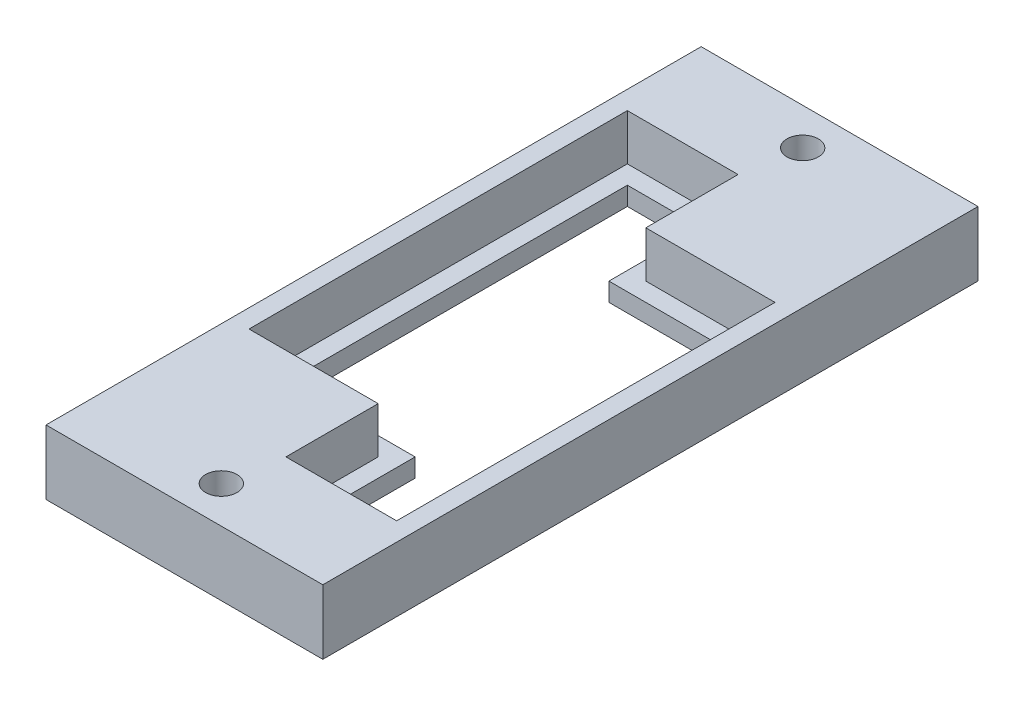
ISO-10303-21;
HEADER;
FILE_DESCRIPTION(('STEP AP214'),'2;1');
FILE_NAME('part.step','',(''),(''),'','','');
FILE_SCHEMA(('AUTOMOTIVE_DESIGN { 1 0 10303 214 1 1 1 1 }'));
ENDSEC;
DATA;
#1=APPLICATION_CONTEXT('core data for automotive mechanical design processes');
#2=APPLICATION_PROTOCOL_DEFINITION('international standard','automotive_design',2000,#1);
#3=PRODUCT_CONTEXT('',#1,'mechanical');
#4=PRODUCT('Part','Part','',(#3));
#5=PRODUCT_RELATED_PRODUCT_CATEGORY('part','',(#4));
#6=PRODUCT_DEFINITION_FORMATION('','',#4);
#7=PRODUCT_DEFINITION_CONTEXT('part definition',#1,'design');
#8=PRODUCT_DEFINITION('design','',#6,#7);
#9=PRODUCT_DEFINITION_SHAPE('','',#8);
#10=(LENGTH_UNIT() NAMED_UNIT(*) SI_UNIT(.MILLI.,.METRE.));
#11=(NAMED_UNIT(*) PLANE_ANGLE_UNIT() SI_UNIT($,.RADIAN.));
#12=(NAMED_UNIT(*) SI_UNIT($,.STERADIAN.) SOLID_ANGLE_UNIT());
#13=UNCERTAINTY_MEASURE_WITH_UNIT(LENGTH_MEASURE(1.E-05),#10,'distance_accuracy_value','');
#14=(GEOMETRIC_REPRESENTATION_CONTEXT(3) GLOBAL_UNCERTAINTY_ASSIGNED_CONTEXT((#13)) GLOBAL_UNIT_ASSIGNED_CONTEXT((#10,
#11,#12)) REPRESENTATION_CONTEXT('',''));
#15=CARTESIAN_POINT('',(0.,0.,0.));
#16=DIRECTION('',(0.,0.,1.));
#17=DIRECTION('',(1.,0.,0.));
#18=AXIS2_PLACEMENT_3D('',#15,#16,#17);
#19=CARTESIAN_POINT('',(-6.02197802197803,2.,0.));
#20=DIRECTION('',(-1.,0.,0.));
#21=DIRECTION('',(0.,0.,1.));
#22=AXIS2_PLACEMENT_3D('',#19,#20,#21);
#23=PLANE('',#22);
#24=DIRECTION('',(0.,0.,-1.));
#25=VECTOR('',#24,1.);
#26=CARTESIAN_POINT('',(-6.02197802197803,0.,0.));
#27=LINE('',#26,#25);
#28=CARTESIAN_POINT('',(-6.02197802197803,0.,-6.26799641166373));
#29=VERTEX_POINT('',#28);
#30=CARTESIAN_POINT('',(-6.02197802197803,0.,-16.2679964116637));
#31=VERTEX_POINT('',#30);
#32=EDGE_CURVE('E180',#29,#31,#27,.T.);
#33=ORIENTED_EDGE('',*,*,#32,.F.);
#34=DIRECTION('',(0.,-1.,0.));
#35=VECTOR('',#34,1.);
#36=CARTESIAN_POINT('',(-6.02197802197803,2.,-6.26799641166373));
#37=LINE('',#36,#35);
#38=CARTESIAN_POINT('',(-6.02197802197803,2.,-6.26799641166373));
#39=VERTEX_POINT('',#38);
#40=EDGE_CURVE('E11',#39,#29,#37,.T.);
#41=ORIENTED_EDGE('',*,*,#40,.F.);
#42=DIRECTION('',(0.,0.,-1.));
#43=VECTOR('',#42,1.);
#44=CARTESIAN_POINT('',(-6.02197802197803,2.,0.));
#45=LINE('',#44,#43);
#46=CARTESIAN_POINT('',(-6.02197802197803,2.,-16.2679964116637));
#47=VERTEX_POINT('',#46);
#48=EDGE_CURVE('E209',#39,#47,#45,.T.);
#49=ORIENTED_EDGE('',*,*,#48,.T.);
#50=DIRECTION('',(0.,-1.,0.));
#51=VECTOR('',#50,1.);
#52=CARTESIAN_POINT('',(-6.02197802197803,2.,-16.2679964116637));
#53=LINE('',#52,#51);
#54=EDGE_CURVE('E99',#47,#31,#53,.T.);
#55=ORIENTED_EDGE('',*,*,#54,.T.);
#56=EDGE_LOOP('',(#33,#41,#49,#55));
#57=FACE_BOUND('',#56,.T.);
#58=ADVANCED_FACE('F45',(#57),#23,.T.);
#59=CARTESIAN_POINT('',(0.,2.,-6.26799641166373));
#60=DIRECTION('',(0.,0.,1.));
#61=DIRECTION('',(1.,0.,0.));
#62=AXIS2_PLACEMENT_3D('',#59,#60,#61);
#63=PLANE('',#62);
#64=DIRECTION('',(-1.,0.,0.));
#65=VECTOR('',#64,1.);
#66=CARTESIAN_POINT('',(0.,0.,-6.26799641166373));
#67=LINE('',#66,#65);
#68=CARTESIAN_POINT('',(7.97802197802194,0.,-6.26799641166374));
#69=VERTEX_POINT('',#68);
#70=EDGE_CURVE('E183',#69,#29,#67,.T.);
#71=ORIENTED_EDGE('',*,*,#70,.F.);
#72=DIRECTION('',(0.,-1.,0.));
#73=VECTOR('',#72,1.);
#74=CARTESIAN_POINT('',(7.97802197802194,2.,-6.26799641166374));
#75=LINE('',#74,#73);
#76=CARTESIAN_POINT('',(7.97802197802194,2.,-6.26799641166374));
#77=VERTEX_POINT('',#76);
#78=EDGE_CURVE('E54',#77,#69,#75,.T.);
#79=ORIENTED_EDGE('',*,*,#78,.F.);
#80=DIRECTION('',(-1.,0.,0.));
#81=VECTOR('',#80,1.);
#82=CARTESIAN_POINT('',(0.,2.,-6.26799641166373));
#83=LINE('',#82,#81);
#84=EDGE_CURVE('E245',#77,#39,#83,.T.);
#85=ORIENTED_EDGE('',*,*,#84,.T.);
#86=ORIENTED_EDGE('',*,*,#40,.T.);
#87=EDGE_LOOP('',(#71,#79,#85,#86));
#88=FACE_BOUND('',#87,.T.);
#89=ADVANCED_FACE('F233',(#88),#63,.T.);
#90=CARTESIAN_POINT('',(7.97802197802194,2.,0.));
#91=DIRECTION('',(-1.,0.,0.));
#92=DIRECTION('',(0.,0.,1.));
#93=AXIS2_PLACEMENT_3D('',#90,#91,#92);
#94=PLANE('',#93);
#95=DIRECTION('',(0.,0.,-1.));
#96=VECTOR('',#95,1.);
#97=CARTESIAN_POINT('',(7.97802197802194,0.,0.));
#98=LINE('',#97,#96);
#99=CARTESIAN_POINT('',(7.97802197802194,0.,30.7320035883363));
#100=VERTEX_POINT('',#99);
#101=EDGE_CURVE('E188',#100,#69,#98,.T.);
#102=ORIENTED_EDGE('',*,*,#101,.F.);
#103=DIRECTION('',(0.,-1.,0.));
#104=VECTOR('',#103,1.);
#105=CARTESIAN_POINT('',(7.97802197802194,2.,30.7320035883363));
#106=LINE('',#105,#104);
#107=CARTESIAN_POINT('',(7.97802197802194,2.,30.7320035883363));
#108=VERTEX_POINT('',#107);
#109=EDGE_CURVE('E220',#108,#100,#106,.T.);
#110=ORIENTED_EDGE('',*,*,#109,.F.);
#111=DIRECTION('',(0.,0.,-1.));
#112=VECTOR('',#111,1.);
#113=CARTESIAN_POINT('',(7.97802197802194,2.,0.));
#114=LINE('',#113,#112);
#115=EDGE_CURVE('E229',#108,#77,#114,.T.);
#116=ORIENTED_EDGE('',*,*,#115,.T.);
#117=ORIENTED_EDGE('',*,*,#78,.T.);
#118=EDGE_LOOP('',(#102,#110,#116,#117));
#119=FACE_BOUND('',#118,.T.);
#120=ADVANCED_FACE('F227',(#119),#94,.T.);
#121=CARTESIAN_POINT('',(0.,2.,30.7320035883363));
#122=DIRECTION('',(0.,0.,-1.));
#123=DIRECTION('',(-1.,0.,0.));
#124=AXIS2_PLACEMENT_3D('',#121,#122,#123);
#125=PLANE('',#124);
#126=DIRECTION('',(1.,0.,0.));
#127=VECTOR('',#126,1.);
#128=CARTESIAN_POINT('',(0.,0.,30.7320035883363));
#129=LINE('',#128,#127);
#130=CARTESIAN_POINT('',(-0.0219780219780545,0.,30.7320035883363));
#131=VERTEX_POINT('',#130);
#132=EDGE_CURVE('E192',#131,#100,#129,.T.);
#133=ORIENTED_EDGE('',*,*,#132,.F.);
#134=DIRECTION('',(0.,-1.,0.));
#135=VECTOR('',#134,1.);
#136=CARTESIAN_POINT('',(-0.0219780219780545,2.,30.7320035883363));
#137=LINE('',#136,#135);
#138=CARTESIAN_POINT('',(-0.0219780219780545,2.,30.7320035883363));
#139=VERTEX_POINT('',#138);
#140=EDGE_CURVE('E217',#139,#131,#137,.T.);
#141=ORIENTED_EDGE('',*,*,#140,.F.);
#142=DIRECTION('',(1.,0.,0.));
#143=VECTOR('',#142,1.);
#144=CARTESIAN_POINT('',(0.,2.,30.7320035883363));
#145=LINE('',#144,#143);
#146=EDGE_CURVE('E243',#139,#108,#145,.T.);
#147=ORIENTED_EDGE('',*,*,#146,.T.);
#148=ORIENTED_EDGE('',*,*,#109,.T.);
#149=EDGE_LOOP('',(#133,#141,#147,#148));
#150=FACE_BOUND('',#149,.T.);
#151=ADVANCED_FACE('F240',(#150),#125,.T.);
#152=CARTESIAN_POINT('',(-0.0219780219780545,2.,0.));
#153=DIRECTION('',(1.,0.,0.));
#154=DIRECTION('',(0.,0.,-1.));
#155=AXIS2_PLACEMENT_3D('',#152,#153,#154);
#156=PLANE('',#155);
#157=DIRECTION('',(0.,0.,1.));
#158=VECTOR('',#157,1.);
#159=CARTESIAN_POINT('',(-0.0219780219780545,0.,0.));
#160=LINE('',#159,#158);
#161=CARTESIAN_POINT('',(-0.0219780219780545,0.,20.7320035883363));
#162=VERTEX_POINT('',#161);
#163=EDGE_CURVE('E196',#162,#131,#160,.T.);
#164=ORIENTED_EDGE('',*,*,#163,.F.);
#165=DIRECTION('',(0.,-1.,0.));
#166=VECTOR('',#165,1.);
#167=CARTESIAN_POINT('',(-0.0219780219780545,2.,20.7320035883363));
#168=LINE('',#167,#166);
#169=CARTESIAN_POINT('',(-0.0219780219780545,2.,20.7320035883363));
#170=VERTEX_POINT('',#169);
#171=EDGE_CURVE('E214',#170,#162,#168,.T.);
#172=ORIENTED_EDGE('',*,*,#171,.F.);
#173=DIRECTION('',(0.,0.,1.));
#174=VECTOR('',#173,1.);
#175=CARTESIAN_POINT('',(-0.0219780219780545,2.,0.));
#176=LINE('',#175,#174);
#177=EDGE_CURVE('E250',#170,#139,#176,.T.);
#178=ORIENTED_EDGE('',*,*,#177,.T.);
#179=ORIENTED_EDGE('',*,*,#140,.T.);
#180=EDGE_LOOP('',(#164,#172,#178,#179));
#181=FACE_BOUND('',#180,.T.);
#182=ADVANCED_FACE('F271',(#181),#156,.T.);
#183=CARTESIAN_POINT('',(0.,2.,20.7320035883363));
#184=DIRECTION('',(0.,0.,-1.));
#185=DIRECTION('',(-1.,0.,0.));
#186=AXIS2_PLACEMENT_3D('',#183,#184,#185);
#187=PLANE('',#186);
#188=DIRECTION('',(1.,0.,0.));
#189=VECTOR('',#188,1.);
#190=CARTESIAN_POINT('',(0.,0.,20.7320035883363));
#191=LINE('',#190,#189);
#192=CARTESIAN_POINT('',(-14.0219780219781,0.,20.7320035883363));
#193=VERTEX_POINT('',#192);
#194=EDGE_CURVE('E200',#193,#162,#191,.T.);
#195=ORIENTED_EDGE('',*,*,#194,.F.);
#196=DIRECTION('',(0.,-1.,0.));
#197=VECTOR('',#196,1.);
#198=CARTESIAN_POINT('',(-14.0219780219781,2.,20.7320035883363));
#199=LINE('',#198,#197);
#200=CARTESIAN_POINT('',(-14.0219780219781,2.,20.7320035883363));
#201=VERTEX_POINT('',#200);
#202=EDGE_CURVE('E130',#201,#193,#199,.T.);
#203=ORIENTED_EDGE('',*,*,#202,.F.);
#204=DIRECTION('',(1.,0.,0.));
#205=VECTOR('',#204,1.);
#206=CARTESIAN_POINT('',(0.,2.,20.7320035883363));
#207=LINE('',#206,#205);
#208=EDGE_CURVE('E140',#201,#170,#207,.T.);
#209=ORIENTED_EDGE('',*,*,#208,.T.);
#210=ORIENTED_EDGE('',*,*,#171,.T.);
#211=EDGE_LOOP('',(#195,#203,#209,#210));
#212=FACE_BOUND('',#211,.T.);
#213=ADVANCED_FACE('F259',(#212),#187,.T.);
#214=CARTESIAN_POINT('',(-14.0219780219781,2.,0.));
#215=DIRECTION('',(1.,0.,0.));
#216=DIRECTION('',(0.,0.,-1.));
#217=AXIS2_PLACEMENT_3D('',#214,#215,#216);
#218=PLANE('',#217);
#219=DIRECTION('',(0.,0.,1.));
#220=VECTOR('',#219,1.);
#221=CARTESIAN_POINT('',(-14.0219780219781,0.,0.));
#222=LINE('',#221,#220);
#223=CARTESIAN_POINT('',(-14.0219780219781,0.,-16.2679964116637));
#224=VERTEX_POINT('',#223);
#225=EDGE_CURVE('E127',#224,#193,#222,.T.);
#226=ORIENTED_EDGE('',*,*,#225,.F.);
#227=DIRECTION('',(0.,-1.,0.));
#228=VECTOR('',#227,1.);
#229=CARTESIAN_POINT('',(-14.0219780219781,2.,-16.2679964116637));
#230=LINE('',#229,#228);
#231=CARTESIAN_POINT('',(-14.0219780219781,2.,-16.2679964116637));
#232=VERTEX_POINT('',#231);
#233=EDGE_CURVE('E92',#232,#224,#230,.T.);
#234=ORIENTED_EDGE('',*,*,#233,.F.);
#235=DIRECTION('',(0.,0.,1.));
#236=VECTOR('',#235,1.);
#237=CARTESIAN_POINT('',(-14.0219780219781,2.,0.));
#238=LINE('',#237,#236);
#239=EDGE_CURVE('E125',#232,#201,#238,.T.);
#240=ORIENTED_EDGE('',*,*,#239,.T.);
#241=ORIENTED_EDGE('',*,*,#202,.T.);
#242=EDGE_LOOP('',(#226,#234,#240,#241));
#243=FACE_BOUND('',#242,.T.);
#244=ADVANCED_FACE('F124',(#243),#218,.T.);
#245=CARTESIAN_POINT('',(0.,2.,-16.2679964116637));
#246=DIRECTION('',(0.,0.,1.));
#247=DIRECTION('',(1.,0.,0.));
#248=AXIS2_PLACEMENT_3D('',#245,#246,#247);
#249=PLANE('',#248);
#250=DIRECTION('',(-1.,0.,0.));
#251=VECTOR('',#250,1.);
#252=CARTESIAN_POINT('',(0.,0.,-16.2679964116637));
#253=LINE('',#252,#251);
#254=EDGE_CURVE('E206',#31,#224,#253,.T.);
#255=ORIENTED_EDGE('',*,*,#254,.F.);
#256=ORIENTED_EDGE('',*,*,#54,.F.);
#257=DIRECTION('',(-1.,0.,0.));
#258=VECTOR('',#257,1.);
#259=CARTESIAN_POINT('',(0.,2.,-16.2679964116637));
#260=LINE('',#259,#258);
#261=EDGE_CURVE('E137',#47,#232,#260,.T.);
#262=ORIENTED_EDGE('',*,*,#261,.T.);
#263=ORIENTED_EDGE('',*,*,#233,.T.);
#264=EDGE_LOOP('',(#255,#256,#262,#263));
#265=FACE_BOUND('',#264,.T.);
#266=ADVANCED_FACE('F143',(#265),#249,.T.);
#267=CARTESIAN_POINT('',(0.,2.,0.));
#268=DIRECTION('',(0.,1.,0.));
#269=DIRECTION('',(0.,0.,1.));
#270=AXIS2_PLACEMENT_3D('',#267,#268,#269);
#271=PLANE('',#270);
#272=ORIENTED_EDGE('',*,*,#48,.F.);
#273=ORIENTED_EDGE('',*,*,#84,.F.);
#274=ORIENTED_EDGE('',*,*,#115,.F.);
#275=ORIENTED_EDGE('',*,*,#146,.F.);
#276=ORIENTED_EDGE('',*,*,#177,.F.);
#277=ORIENTED_EDGE('',*,*,#208,.F.);
#278=ORIENTED_EDGE('',*,*,#239,.F.);
#279=ORIENTED_EDGE('',*,*,#261,.F.);
#280=EDGE_LOOP('',(#272,#273,#274,#275,#276,#277,#278,#279));
#281=FACE_BOUND('',#280,.T.);
#282=DIRECTION('',(0.,0.,-1.));
#283=VECTOR('',#282,1.);
#284=CARTESIAN_POINT('',(-4.02197802197803,2.,0.));
#285=LINE('',#284,#283);
#286=CARTESIAN_POINT('',(-4.02197802197803,2.,-8.26799641166373));
#287=VERTEX_POINT('',#286);
#288=CARTESIAN_POINT('',(-4.02197802197803,2.,-18.2679964116637));
#289=VERTEX_POINT('',#288);
#290=EDGE_CURVE('E145',#287,#289,#285,.T.);
#291=ORIENTED_EDGE('',*,*,#290,.T.);
#292=DIRECTION('',(-1.,0.,0.));
#293=VECTOR('',#292,1.);
#294=CARTESIAN_POINT('',(0.,2.,-18.2679964116637));
#295=LINE('',#294,#293);
#296=CARTESIAN_POINT('',(-16.0219780219781,2.,-18.2679964116637));
#297=VERTEX_POINT('',#296);
#298=EDGE_CURVE('E149',#289,#297,#295,.T.);
#299=ORIENTED_EDGE('',*,*,#298,.T.);
#300=DIRECTION('',(0.,0.,1.));
#301=VECTOR('',#300,1.);
#302=CARTESIAN_POINT('',(-16.0219780219781,2.,0.));
#303=LINE('',#302,#301);
#304=CARTESIAN_POINT('',(-16.0219780219781,2.,22.7320035883363));
#305=VERTEX_POINT('',#304);
#306=EDGE_CURVE('E156',#297,#305,#303,.T.);
#307=ORIENTED_EDGE('',*,*,#306,.T.);
#308=DIRECTION('',(1.,0.,0.));
#309=VECTOR('',#308,1.);
#310=CARTESIAN_POINT('',(0.,2.,22.7320035883363));
#311=LINE('',#310,#309);
#312=CARTESIAN_POINT('',(-2.02197802197805,2.,22.7320035883363));
#313=VERTEX_POINT('',#312);
#314=EDGE_CURVE('E160',#305,#313,#311,.T.);
#315=ORIENTED_EDGE('',*,*,#314,.T.);
#316=DIRECTION('',(0.,0.,1.));
#317=VECTOR('',#316,1.);
#318=CARTESIAN_POINT('',(-2.02197802197806,2.,0.));
#319=LINE('',#318,#317);
#320=CARTESIAN_POINT('',(-2.02197802197805,2.,32.7320035883363));
#321=VERTEX_POINT('',#320);
#322=EDGE_CURVE('E164',#313,#321,#319,.T.);
#323=ORIENTED_EDGE('',*,*,#322,.T.);
#324=DIRECTION('',(1.,0.,0.));
#325=VECTOR('',#324,1.);
#326=CARTESIAN_POINT('',(0.,2.,32.7320035883363));
#327=LINE('',#326,#325);
#328=CARTESIAN_POINT('',(9.97802197802194,2.,32.7320035883363));
#329=VERTEX_POINT('',#328);
#330=EDGE_CURVE('E168',#321,#329,#327,.T.);
#331=ORIENTED_EDGE('',*,*,#330,.T.);
#332=DIRECTION('',(0.,0.,-1.));
#333=VECTOR('',#332,1.);
#334=CARTESIAN_POINT('',(9.97802197802194,2.,0.));
#335=LINE('',#334,#333);
#336=CARTESIAN_POINT('',(9.97802197802194,2.,-8.26799641166374));
#337=VERTEX_POINT('',#336);
#338=EDGE_CURVE('E172',#329,#337,#335,.T.);
#339=ORIENTED_EDGE('',*,*,#338,.T.);
#340=DIRECTION('',(-1.,0.,0.));
#341=VECTOR('',#340,1.);
#342=CARTESIAN_POINT('',(0.,2.,-8.26799641166373));
#343=LINE('',#342,#341);
#344=EDGE_CURVE('E176',#337,#287,#343,.T.);
#345=ORIENTED_EDGE('',*,*,#344,.T.);
#346=EDGE_LOOP('',(#291,#299,#307,#315,#323,#331,#339,#345));
#347=FACE_BOUND('',#346,.T.);
#348=ADVANCED_FACE('F135',(#281,#347),#271,.T.);
#349=CARTESIAN_POINT('',(0.,0.,0.));
#350=DIRECTION('',(0.,1.,0.));
#351=DIRECTION('',(0.,0.,1.));
#352=AXIS2_PLACEMENT_3D('',#349,#350,#351);
#353=PLANE('',#352);
#354=DIRECTION('',(0.,0.,-1.));
#355=VECTOR('',#354,1.);
#356=CARTESIAN_POINT('',(11.9780219780219,0.,0.));
#357=LINE('',#356,#355);
#358=CARTESIAN_POINT('',(11.9780219780219,0.,42.7320035883363));
#359=VERTEX_POINT('',#358);
#360=CARTESIAN_POINT('',(11.9780219780219,0.,-28.2679964116637));
#361=VERTEX_POINT('',#360);
#362=EDGE_CURVE('E405',#359,#361,#357,.T.);
#363=ORIENTED_EDGE('',*,*,#362,.F.);
#364=DIRECTION('',(1.,0.,0.));
#365=VECTOR('',#364,1.);
#366=CARTESIAN_POINT('',(0.,0.,42.7320035883363));
#367=LINE('',#366,#365);
#368=CARTESIAN_POINT('',(-18.0219780219781,0.,42.7320035883363));
#369=VERTEX_POINT('',#368);
#370=EDGE_CURVE('E387',#369,#359,#367,.T.);
#371=ORIENTED_EDGE('',*,*,#370,.F.);
#372=DIRECTION('',(0.,0.,1.));
#373=VECTOR('',#372,1.);
#374=CARTESIAN_POINT('',(-18.0219780219781,0.,0.));
#375=LINE('',#374,#373);
#376=CARTESIAN_POINT('',(-18.0219780219781,0.,-28.2679964116637));
#377=VERTEX_POINT('',#376);
#378=EDGE_CURVE('E411',#377,#369,#375,.T.);
#379=ORIENTED_EDGE('',*,*,#378,.F.);
#380=DIRECTION('',(1.,0.,0.));
#381=VECTOR('',#380,1.);
#382=CARTESIAN_POINT('',(0.,0.,-28.2679964116637));
#383=LINE('',#382,#381);
#384=EDGE_CURVE('E351',#377,#361,#383,.T.);
#385=ORIENTED_EDGE('',*,*,#384,.T.);
#386=EDGE_LOOP('',(#363,#371,#379,#385));
#387=FACE_BOUND('',#386,.T.);
#388=ORIENTED_EDGE('',*,*,#32,.T.);
#389=ORIENTED_EDGE('',*,*,#254,.T.);
#390=ORIENTED_EDGE('',*,*,#225,.T.);
#391=ORIENTED_EDGE('',*,*,#194,.T.);
#392=ORIENTED_EDGE('',*,*,#163,.T.);
#393=ORIENTED_EDGE('',*,*,#132,.T.);
#394=ORIENTED_EDGE('',*,*,#101,.T.);
#395=ORIENTED_EDGE('',*,*,#70,.T.);
#396=EDGE_LOOP('',(#388,#389,#390,#391,#392,#393,#394,#395));
#397=FACE_BOUND('',#396,.T.);
#398=CARTESIAN_POINT('',(-3.02197802197805,0.,38.7320035883363));
#399=DIRECTION('',(0.,1.,0.));
#400=DIRECTION('',(0.,0.,1.));
#401=AXIS2_PLACEMENT_3D('',#398,#399,#400);
#402=CIRCLE('',#401,1.7);
#403=CARTESIAN_POINT('',(-3.02197802197805,0.,40.4320035883363));
#404=VERTEX_POINT('',#403);
#405=EDGE_CURVE('E381',#404,#404,#402,.T.);
#406=ORIENTED_EDGE('',*,*,#405,.T.);
#407=EDGE_LOOP('',(#406));
#408=FACE_BOUND('',#407,.T.);
#409=CARTESIAN_POINT('',(-3.02197802197806,0.,-24.2679964116637));
#410=DIRECTION('',(0.,1.,0.));
#411=DIRECTION('',(0.,0.,1.));
#412=AXIS2_PLACEMENT_3D('',#409,#410,#411);
#413=CIRCLE('',#412,1.7);
#414=CARTESIAN_POINT('',(-3.02197802197806,0.,-22.5679964116637));
#415=VERTEX_POINT('',#414);
#416=EDGE_CURVE('E366',#415,#415,#413,.T.);
#417=ORIENTED_EDGE('',*,*,#416,.T.);
#418=EDGE_LOOP('',(#417));
#419=FACE_BOUND('',#418,.T.);
#420=ADVANCED_FACE('F235',(#387,#397,#408,#419),#353,.F.);
#421=CARTESIAN_POINT('',(11.9780219780219,7.,0.));
#422=DIRECTION('',(-1.,0.,0.));
#423=DIRECTION('',(0.,0.,1.));
#424=AXIS2_PLACEMENT_3D('',#421,#422,#423);
#425=PLANE('',#424);
#426=ORIENTED_EDGE('',*,*,#362,.T.);
#427=DIRECTION('',(0.,-1.,0.));
#428=VECTOR('',#427,1.);
#429=CARTESIAN_POINT('',(11.9780219780219,7.,-28.2679964116637));
#430=LINE('',#429,#428);
#431=CARTESIAN_POINT('',(11.9780219780219,7.,-28.2679964116637));
#432=VERTEX_POINT('',#431);
#433=EDGE_CURVE('E359',#432,#361,#430,.T.);
#434=ORIENTED_EDGE('',*,*,#433,.F.);
#435=DIRECTION('',(0.,0.,-1.));
#436=VECTOR('',#435,1.);
#437=CARTESIAN_POINT('',(11.9780219780219,7.,0.));
#438=LINE('',#437,#436);
#439=CARTESIAN_POINT('',(11.9780219780219,7.,42.7320035883363));
#440=VERTEX_POINT('',#439);
#441=EDGE_CURVE('E438',#440,#432,#438,.T.);
#442=ORIENTED_EDGE('',*,*,#441,.F.);
#443=DIRECTION('',(0.,-1.,0.));
#444=VECTOR('',#443,1.);
#445=CARTESIAN_POINT('',(11.9780219780219,7.,42.7320035883363));
#446=LINE('',#445,#444);
#447=EDGE_CURVE('E401',#440,#359,#446,.T.);
#448=ORIENTED_EDGE('',*,*,#447,.T.);
#449=EDGE_LOOP('',(#426,#434,#442,#448));
#450=FACE_BOUND('',#449,.T.);
#451=ADVANCED_FACE('F283',(#450),#425,.F.);
#452=CARTESIAN_POINT('',(-18.0219780219781,7.,0.));
#453=DIRECTION('',(1.,0.,0.));
#454=DIRECTION('',(0.,0.,-1.));
#455=AXIS2_PLACEMENT_3D('',#452,#453,#454);
#456=PLANE('',#455);
#457=ORIENTED_EDGE('',*,*,#378,.T.);
#458=DIRECTION('',(0.,-1.,0.));
#459=VECTOR('',#458,1.);
#460=CARTESIAN_POINT('',(-18.0219780219781,7.,42.7320035883363));
#461=LINE('',#460,#459);
#462=CARTESIAN_POINT('',(-18.0219780219781,7.,42.7320035883363));
#463=VERTEX_POINT('',#462);
#464=EDGE_CURVE('E391',#463,#369,#461,.T.);
#465=ORIENTED_EDGE('',*,*,#464,.F.);
#466=DIRECTION('',(0.,0.,1.));
#467=VECTOR('',#466,1.);
#468=CARTESIAN_POINT('',(-18.0219780219781,7.,0.));
#469=LINE('',#468,#467);
#470=CARTESIAN_POINT('',(-18.0219780219781,7.,-28.2679964116637));
#471=VERTEX_POINT('',#470);
#472=EDGE_CURVE('E442',#471,#463,#469,.T.);
#473=ORIENTED_EDGE('',*,*,#472,.F.);
#474=DIRECTION('',(0.,-1.,0.));
#475=VECTOR('',#474,1.);
#476=CARTESIAN_POINT('',(-18.0219780219781,7.,-28.2679964116637));
#477=LINE('',#476,#475);
#478=EDGE_CURVE('E355',#471,#377,#477,.T.);
#479=ORIENTED_EDGE('',*,*,#478,.T.);
#480=EDGE_LOOP('',(#457,#465,#473,#479));
#481=FACE_BOUND('',#480,.T.);
#482=ADVANCED_FACE('F291',(#481),#456,.F.);
#483=CARTESIAN_POINT('',(0.,7.,-18.2679964116637));
#484=DIRECTION('',(0.,0.,1.));
#485=DIRECTION('',(1.,0.,0.));
#486=AXIS2_PLACEMENT_3D('',#483,#484,#485);
#487=PLANE('',#486);
#488=DIRECTION('',(0.,-1.,0.));
#489=VECTOR('',#488,1.);
#490=CARTESIAN_POINT('',(-16.0219780219781,7.,-18.2679964116637));
#491=LINE('',#490,#489);
#492=CARTESIAN_POINT('',(-16.0219780219781,7.,-18.2679964116637));
#493=VERTEX_POINT('',#492);
#494=EDGE_CURVE('E446',#493,#297,#491,.T.);
#495=ORIENTED_EDGE('',*,*,#494,.T.);
#496=ORIENTED_EDGE('',*,*,#298,.F.);
#497=DIRECTION('',(0.,-1.,0.));
#498=VECTOR('',#497,1.);
#499=CARTESIAN_POINT('',(-4.02197802197803,7.,-18.2679964116637));
#500=LINE('',#499,#498);
#501=CARTESIAN_POINT('',(-4.02197802197803,7.,-18.2679964116637));
#502=VERTEX_POINT('',#501);
#503=EDGE_CURVE('E184',#502,#289,#500,.T.);
#504=ORIENTED_EDGE('',*,*,#503,.F.);
#505=DIRECTION('',(-1.,0.,0.));
#506=VECTOR('',#505,1.);
#507=CARTESIAN_POINT('',(0.,7.,-18.2679964116637));
#508=LINE('',#507,#506);
#509=EDGE_CURVE('E406',#502,#493,#508,.T.);
#510=ORIENTED_EDGE('',*,*,#509,.T.);
#511=EDGE_LOOP('',(#495,#496,#504,#510));
#512=FACE_BOUND('',#511,.T.);
#513=ADVANCED_FACE('F287',(#512),#487,.T.);
#514=CARTESIAN_POINT('',(-4.02197802197803,7.,0.));
#515=DIRECTION('',(-1.,0.,0.));
#516=DIRECTION('',(0.,0.,1.));
#517=AXIS2_PLACEMENT_3D('',#514,#515,#516);
#518=PLANE('',#517);
#519=ORIENTED_EDGE('',*,*,#503,.T.);
#520=ORIENTED_EDGE('',*,*,#290,.F.);
#521=DIRECTION('',(0.,-1.,0.));
#522=VECTOR('',#521,1.);
#523=CARTESIAN_POINT('',(-4.02197802197803,7.,-8.26799641166373));
#524=LINE('',#523,#522);
#525=CARTESIAN_POINT('',(-4.02197802197803,7.,-8.26799641166373));
#526=VERTEX_POINT('',#525);
#527=EDGE_CURVE('E474',#526,#287,#524,.T.);
#528=ORIENTED_EDGE('',*,*,#527,.F.);
#529=DIRECTION('',(0.,0.,-1.));
#530=VECTOR('',#529,1.);
#531=CARTESIAN_POINT('',(-4.02197802197803,7.,0.));
#532=LINE('',#531,#530);
#533=EDGE_CURVE('E410',#526,#502,#532,.T.);
#534=ORIENTED_EDGE('',*,*,#533,.T.);
#535=EDGE_LOOP('',(#519,#520,#528,#534));
#536=FACE_BOUND('',#535,.T.);
#537=ADVANCED_FACE('F290',(#536),#518,.T.);
#538=CARTESIAN_POINT('',(0.,7.,-8.26799641166373));
#539=DIRECTION('',(0.,0.,1.));
#540=DIRECTION('',(1.,0.,0.));
#541=AXIS2_PLACEMENT_3D('',#538,#539,#540);
#542=PLANE('',#541);
#543=ORIENTED_EDGE('',*,*,#527,.T.);
#544=ORIENTED_EDGE('',*,*,#344,.F.);
#545=DIRECTION('',(0.,-1.,0.));
#546=VECTOR('',#545,1.);
#547=CARTESIAN_POINT('',(9.97802197802194,7.,-8.26799641166374));
#548=LINE('',#547,#546);
#549=CARTESIAN_POINT('',(9.97802197802194,7.,-8.26799641166374));
#550=VERTEX_POINT('',#549);
#551=EDGE_CURVE('E470',#550,#337,#548,.T.);
#552=ORIENTED_EDGE('',*,*,#551,.F.);
#553=DIRECTION('',(-1.,0.,0.));
#554=VECTOR('',#553,1.);
#555=CARTESIAN_POINT('',(0.,7.,-8.26799641166373));
#556=LINE('',#555,#554);
#557=EDGE_CURVE('E415',#550,#526,#556,.T.);
#558=ORIENTED_EDGE('',*,*,#557,.T.);
#559=EDGE_LOOP('',(#543,#544,#552,#558));
#560=FACE_BOUND('',#559,.T.);
#561=ADVANCED_FACE('F295',(#560),#542,.T.);
#562=CARTESIAN_POINT('',(9.97802197802194,7.,0.));
#563=DIRECTION('',(-1.,0.,0.));
#564=DIRECTION('',(0.,0.,1.));
#565=AXIS2_PLACEMENT_3D('',#562,#563,#564);
#566=PLANE('',#565);
#567=ORIENTED_EDGE('',*,*,#551,.T.);
#568=ORIENTED_EDGE('',*,*,#338,.F.);
#569=DIRECTION('',(0.,-1.,0.));
#570=VECTOR('',#569,1.);
#571=CARTESIAN_POINT('',(9.97802197802194,7.,32.7320035883363));
#572=LINE('',#571,#570);
#573=CARTESIAN_POINT('',(9.97802197802194,7.,32.7320035883363));
#574=VERTEX_POINT('',#573);
#575=EDGE_CURVE('E466',#574,#329,#572,.T.);
#576=ORIENTED_EDGE('',*,*,#575,.F.);
#577=DIRECTION('',(0.,0.,-1.));
#578=VECTOR('',#577,1.);
#579=CARTESIAN_POINT('',(9.97802197802194,7.,0.));
#580=LINE('',#579,#578);
#581=EDGE_CURVE('E419',#574,#550,#580,.T.);
#582=ORIENTED_EDGE('',*,*,#581,.T.);
#583=EDGE_LOOP('',(#567,#568,#576,#582));
#584=FACE_BOUND('',#583,.T.);
#585=ADVANCED_FACE('F299',(#584),#566,.T.);
#586=CARTESIAN_POINT('',(0.,7.,32.7320035883363));
#587=DIRECTION('',(0.,0.,-1.));
#588=DIRECTION('',(-1.,0.,0.));
#589=AXIS2_PLACEMENT_3D('',#586,#587,#588);
#590=PLANE('',#589);
#591=ORIENTED_EDGE('',*,*,#575,.T.);
#592=ORIENTED_EDGE('',*,*,#330,.F.);
#593=DIRECTION('',(0.,-1.,0.));
#594=VECTOR('',#593,1.);
#595=CARTESIAN_POINT('',(-2.02197802197805,7.,32.7320035883363));
#596=LINE('',#595,#594);
#597=CARTESIAN_POINT('',(-2.02197802197805,7.,32.7320035883363));
#598=VERTEX_POINT('',#597);
#599=EDGE_CURVE('E462',#598,#321,#596,.T.);
#600=ORIENTED_EDGE('',*,*,#599,.F.);
#601=DIRECTION('',(1.,0.,0.));
#602=VECTOR('',#601,1.);
#603=CARTESIAN_POINT('',(0.,7.,32.7320035883363));
#604=LINE('',#603,#602);
#605=EDGE_CURVE('E423',#598,#574,#604,.T.);
#606=ORIENTED_EDGE('',*,*,#605,.T.);
#607=EDGE_LOOP('',(#591,#592,#600,#606));
#608=FACE_BOUND('',#607,.T.);
#609=ADVANCED_FACE('F303',(#608),#590,.T.);
#610=CARTESIAN_POINT('',(-2.02197802197806,7.,0.));
#611=DIRECTION('',(1.,0.,0.));
#612=DIRECTION('',(0.,0.,-1.));
#613=AXIS2_PLACEMENT_3D('',#610,#611,#612);
#614=PLANE('',#613);
#615=ORIENTED_EDGE('',*,*,#599,.T.);
#616=ORIENTED_EDGE('',*,*,#322,.F.);
#617=DIRECTION('',(0.,-1.,0.));
#618=VECTOR('',#617,1.);
#619=CARTESIAN_POINT('',(-2.02197802197805,7.,22.7320035883363));
#620=LINE('',#619,#618);
#621=CARTESIAN_POINT('',(-2.02197802197805,7.,22.7320035883363));
#622=VERTEX_POINT('',#621);
#623=EDGE_CURVE('E458',#622,#313,#620,.T.);
#624=ORIENTED_EDGE('',*,*,#623,.F.);
#625=DIRECTION('',(0.,0.,1.));
#626=VECTOR('',#625,1.);
#627=CARTESIAN_POINT('',(-2.02197802197806,7.,0.));
#628=LINE('',#627,#626);
#629=EDGE_CURVE('E427',#622,#598,#628,.T.);
#630=ORIENTED_EDGE('',*,*,#629,.T.);
#631=EDGE_LOOP('',(#615,#616,#624,#630));
#632=FACE_BOUND('',#631,.T.);
#633=ADVANCED_FACE('F307',(#632),#614,.T.);
#634=CARTESIAN_POINT('',(0.,7.,22.7320035883363));
#635=DIRECTION('',(0.,0.,-1.));
#636=DIRECTION('',(-1.,0.,0.));
#637=AXIS2_PLACEMENT_3D('',#634,#635,#636);
#638=PLANE('',#637);
#639=ORIENTED_EDGE('',*,*,#623,.T.);
#640=ORIENTED_EDGE('',*,*,#314,.F.);
#641=DIRECTION('',(0.,-1.,0.));
#642=VECTOR('',#641,1.);
#643=CARTESIAN_POINT('',(-16.0219780219781,7.,22.7320035883363));
#644=LINE('',#643,#642);
#645=CARTESIAN_POINT('',(-16.0219780219781,7.,22.7320035883363));
#646=VERTEX_POINT('',#645);
#647=EDGE_CURVE('E62',#646,#305,#644,.T.);
#648=ORIENTED_EDGE('',*,*,#647,.F.);
#649=DIRECTION('',(1.,0.,0.));
#650=VECTOR('',#649,1.);
#651=CARTESIAN_POINT('',(0.,7.,22.7320035883363));
#652=LINE('',#651,#650);
#653=EDGE_CURVE('E431',#646,#622,#652,.T.);
#654=ORIENTED_EDGE('',*,*,#653,.T.);
#655=EDGE_LOOP('',(#639,#640,#648,#654));
#656=FACE_BOUND('',#655,.T.);
#657=ADVANCED_FACE('F311',(#656),#638,.T.);
#658=CARTESIAN_POINT('',(-16.0219780219781,7.,0.));
#659=DIRECTION('',(1.,0.,0.));
#660=DIRECTION('',(0.,0.,-1.));
#661=AXIS2_PLACEMENT_3D('',#658,#659,#660);
#662=PLANE('',#661);
#663=ORIENTED_EDGE('',*,*,#647,.T.);
#664=ORIENTED_EDGE('',*,*,#306,.F.);
#665=ORIENTED_EDGE('',*,*,#494,.F.);
#666=DIRECTION('',(0.,0.,1.));
#667=VECTOR('',#666,1.);
#668=CARTESIAN_POINT('',(-16.0219780219781,7.,0.));
#669=LINE('',#668,#667);
#670=EDGE_CURVE('E435',#493,#646,#669,.T.);
#671=ORIENTED_EDGE('',*,*,#670,.T.);
#672=EDGE_LOOP('',(#663,#664,#665,#671));
#673=FACE_BOUND('',#672,.T.);
#674=ADVANCED_FACE('F315',(#673),#662,.T.);
#675=CARTESIAN_POINT('',(0.,7.,0.));
#676=DIRECTION('',(0.,1.,0.));
#677=DIRECTION('',(0.,0.,1.));
#678=AXIS2_PLACEMENT_3D('',#675,#676,#677);
#679=PLANE('',#678);
#680=DIRECTION('',(1.,0.,0.));
#681=VECTOR('',#680,1.);
#682=CARTESIAN_POINT('',(0.,7.,-28.2679964116637));
#683=LINE('',#682,#681);
#684=EDGE_CURVE('E371',#471,#432,#683,.T.);
#685=ORIENTED_EDGE('',*,*,#684,.F.);
#686=ORIENTED_EDGE('',*,*,#472,.T.);
#687=DIRECTION('',(1.,0.,0.));
#688=VECTOR('',#687,1.);
#689=CARTESIAN_POINT('',(0.,7.,42.7320035883363));
#690=LINE('',#689,#688);
#691=EDGE_CURVE('E386',#463,#440,#690,.T.);
#692=ORIENTED_EDGE('',*,*,#691,.T.);
#693=ORIENTED_EDGE('',*,*,#441,.T.);
#694=EDGE_LOOP('',(#685,#686,#692,#693));
#695=FACE_BOUND('',#694,.T.);
#696=ORIENTED_EDGE('',*,*,#509,.F.);
#697=ORIENTED_EDGE('',*,*,#533,.F.);
#698=ORIENTED_EDGE('',*,*,#557,.F.);
#699=ORIENTED_EDGE('',*,*,#581,.F.);
#700=ORIENTED_EDGE('',*,*,#605,.F.);
#701=ORIENTED_EDGE('',*,*,#629,.F.);
#702=ORIENTED_EDGE('',*,*,#653,.F.);
#703=ORIENTED_EDGE('',*,*,#670,.F.);
#704=EDGE_LOOP('',(#696,#697,#698,#699,#700,#701,#702,#703));
#705=FACE_BOUND('',#704,.T.);
#706=CARTESIAN_POINT('',(-3.02197802197805,7.,38.7320035883363));
#707=DIRECTION('',(0.,1.,0.));
#708=DIRECTION('',(0.,0.,1.));
#709=AXIS2_PLACEMENT_3D('',#706,#707,#708);
#710=CIRCLE('',#709,1.7);
#711=CARTESIAN_POINT('',(-3.02197802197805,7.,40.4320035883363));
#712=VERTEX_POINT('',#711);
#713=EDGE_CURVE('E382',#712,#712,#710,.T.);
#714=ORIENTED_EDGE('',*,*,#713,.F.);
#715=EDGE_LOOP('',(#714));
#716=FACE_BOUND('',#715,.T.);
#717=CARTESIAN_POINT('',(-3.02197802197806,7.,-24.2679964116637));
#718=DIRECTION('',(0.,1.,0.));
#719=DIRECTION('',(0.,0.,1.));
#720=AXIS2_PLACEMENT_3D('',#717,#718,#719);
#721=CIRCLE('',#720,1.7);
#722=CARTESIAN_POINT('',(-3.02197802197806,7.,-22.5679964116637));
#723=VERTEX_POINT('',#722);
#724=EDGE_CURVE('E365',#723,#723,#721,.T.);
#725=ORIENTED_EDGE('',*,*,#724,.F.);
#726=EDGE_LOOP('',(#725));
#727=FACE_BOUND('',#726,.T.);
#728=ADVANCED_FACE('F319',(#695,#705,#716,#727),#679,.T.);
#729=CARTESIAN_POINT('',(0.,7.,42.7320035883363));
#730=DIRECTION('',(0.,0.,-1.));
#731=DIRECTION('',(-1.,0.,0.));
#732=AXIS2_PLACEMENT_3D('',#729,#730,#731);
#733=PLANE('',#732);
#734=ORIENTED_EDGE('',*,*,#370,.T.);
#735=ORIENTED_EDGE('',*,*,#447,.F.);
#736=ORIENTED_EDGE('',*,*,#691,.F.);
#737=ORIENTED_EDGE('',*,*,#464,.T.);
#738=EDGE_LOOP('',(#734,#735,#736,#737));
#739=FACE_BOUND('',#738,.T.);
#740=ADVANCED_FACE('F328',(#739),#733,.F.);
#741=CARTESIAN_POINT('',(-3.02197802197805,7.,38.7320035883363));
#742=DIRECTION('',(0.,-1.,0.));
#743=DIRECTION('',(0.,0.,-1.));
#744=AXIS2_PLACEMENT_3D('',#741,#742,#743);
#745=CYLINDRICAL_SURFACE('',#744,1.7);
#746=ORIENTED_EDGE('',*,*,#713,.T.);
#747=EDGE_LOOP('',(#746));
#748=FACE_BOUND('',#747,.T.);
#749=ORIENTED_EDGE('',*,*,#405,.F.);
#750=EDGE_LOOP('',(#749));
#751=FACE_BOUND('',#750,.T.);
#752=ADVANCED_FACE('F330',(#748,#751),#745,.F.);
#753=CARTESIAN_POINT('',(0.,7.,-28.2679964116637));
#754=DIRECTION('',(0.,0.,-1.));
#755=DIRECTION('',(-1.,0.,0.));
#756=AXIS2_PLACEMENT_3D('',#753,#754,#755);
#757=PLANE('',#756);
#758=ORIENTED_EDGE('',*,*,#384,.F.);
#759=ORIENTED_EDGE('',*,*,#478,.F.);
#760=ORIENTED_EDGE('',*,*,#684,.T.);
#761=ORIENTED_EDGE('',*,*,#433,.T.);
#762=EDGE_LOOP('',(#758,#759,#760,#761));
#763=FACE_BOUND('',#762,.T.);
#764=ADVANCED_FACE('F333',(#763),#757,.T.);
#765=CARTESIAN_POINT('',(-3.02197802197806,7.,-24.2679964116637));
#766=DIRECTION('',(0.,-1.,0.));
#767=DIRECTION('',(0.,0.,-1.));
#768=AXIS2_PLACEMENT_3D('',#765,#766,#767);
#769=CYLINDRICAL_SURFACE('',#768,1.7);
#770=ORIENTED_EDGE('',*,*,#724,.T.);
#771=EDGE_LOOP('',(#770));
#772=FACE_BOUND('',#771,.T.);
#773=ORIENTED_EDGE('',*,*,#416,.F.);
#774=EDGE_LOOP('',(#773));
#775=FACE_BOUND('',#774,.T.);
#776=ADVANCED_FACE('F338',(#772,#775),#769,.F.);
#777=CLOSED_SHELL('',(#58,#89,#120,#151,#182,#213,#244,#266,#348,#420,#451,#482,#513,#537,#561,
#585,#609,#633,#657,#674,#728,#740,#752,#764,#776));
#778=MANIFOLD_SOLID_BREP('B2',#777);
#779=ADVANCED_BREP_SHAPE_REPRESENTATION('',(#18,#778),#14);
#780=SHAPE_DEFINITION_REPRESENTATION(#9,#779);
ENDSEC;
END-ISO-10303-21;
